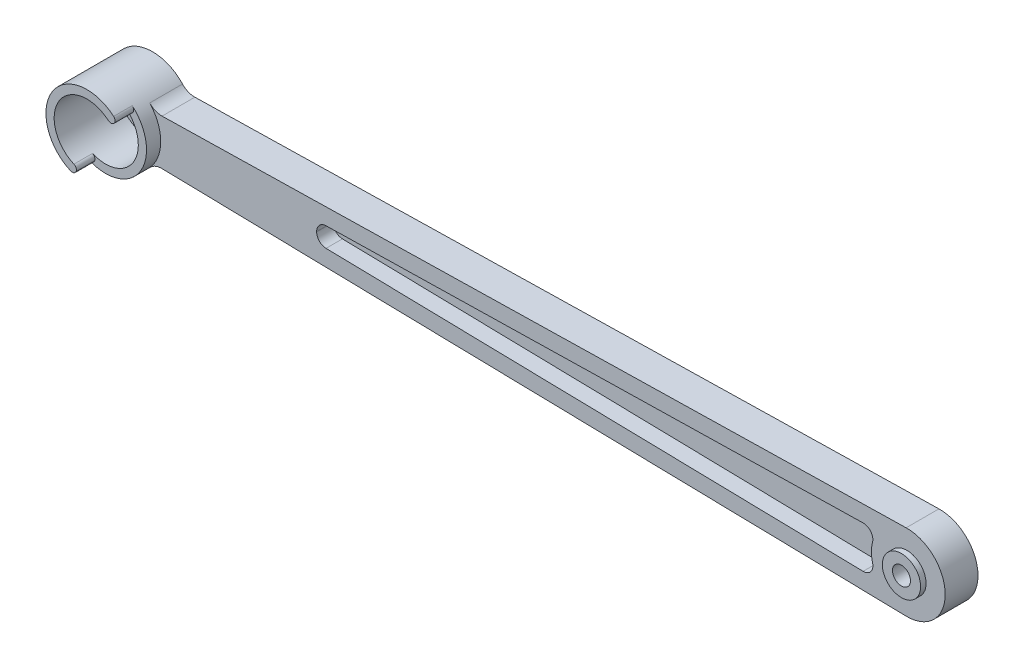
ISO-10303-21;
HEADER;
FILE_DESCRIPTION(('STEP AP214'),'2;1');
FILE_NAME('part.step','',(''),(''),'','','');
FILE_SCHEMA(('AUTOMOTIVE_DESIGN { 1 0 10303 214 1 1 1 1 }'));
ENDSEC;
DATA;
#1=APPLICATION_CONTEXT('core data for automotive mechanical design processes');
#2=APPLICATION_PROTOCOL_DEFINITION('international standard','automotive_design',2000,#1);
#3=PRODUCT_CONTEXT('',#1,'mechanical');
#4=PRODUCT('Part','Part','',(#3));
#5=PRODUCT_RELATED_PRODUCT_CATEGORY('part','',(#4));
#6=PRODUCT_DEFINITION_FORMATION('','',#4);
#7=PRODUCT_DEFINITION_CONTEXT('part definition',#1,'design');
#8=PRODUCT_DEFINITION('design','',#6,#7);
#9=PRODUCT_DEFINITION_SHAPE('','',#8);
#10=(LENGTH_UNIT() NAMED_UNIT(*) SI_UNIT(.MILLI.,.METRE.));
#11=(NAMED_UNIT(*) PLANE_ANGLE_UNIT() SI_UNIT($,.RADIAN.));
#12=(NAMED_UNIT(*) SI_UNIT($,.STERADIAN.) SOLID_ANGLE_UNIT());
#13=UNCERTAINTY_MEASURE_WITH_UNIT(LENGTH_MEASURE(1.E-05),#10,'distance_accuracy_value','');
#14=(GEOMETRIC_REPRESENTATION_CONTEXT(3) GLOBAL_UNCERTAINTY_ASSIGNED_CONTEXT((#13)) GLOBAL_UNIT_ASSIGNED_CONTEXT((#10,
#11,#12)) REPRESENTATION_CONTEXT('',''));
#15=CARTESIAN_POINT('',(0.,0.,0.));
#16=DIRECTION('',(0.,0.,1.));
#17=DIRECTION('',(1.,0.,0.));
#18=AXIS2_PLACEMENT_3D('',#15,#16,#17);
#19=CARTESIAN_POINT('',(0.,0.,6.));
#20=DIRECTION('',(0.,0.,1.));
#21=DIRECTION('',(1.,0.,0.));
#22=AXIS2_PLACEMENT_3D('',#19,#20,#21);
#23=PLANE('',#22);
#24=CARTESIAN_POINT('',(-106.225718101395,-0.0369722305792602,6.));
#25=DIRECTION('',(0.,0.,1.));
#26=DIRECTION('',(-1.,0.,0.));
#27=AXIS2_PLACEMENT_3D('',#24,#25,#26);
#28=CIRCLE('',#27,1.75);
#29=CARTESIAN_POINT('',(-107.975717263159,-0.0352593886860398,6.));
#30=VERTEX_POINT('',#29);
#31=CARTESIAN_POINT('',(-106.262176434729,-1.78659241505661,6.));
#32=VERTEX_POINT('',#31);
#33=EDGE_CURVE('E65',#30,#32,#28,.T.);
#34=ORIENTED_EDGE('',*,*,#33,.F.);
#35=CARTESIAN_POINT('',(-144.,0.,6.));
#36=DIRECTION('',(0.,0.,-1.));
#37=DIRECTION('',(-1.,0.,0.));
#38=AXIS2_PLACEMENT_3D('',#35,#36,#37);
#39=CIRCLE('',#38,36.024299992205);
#40=CARTESIAN_POINT('',(-107.975717263159,0.035259388686048,6.));
#41=VERTEX_POINT('',#40);
#42=EDGE_CURVE('E218',#41,#30,#39,.T.);
#43=ORIENTED_EDGE('',*,*,#42,.F.);
#44=CARTESIAN_POINT('',(-106.225718101395,0.0369722305792741,6.));
#45=DIRECTION('',(0.,0.,1.));
#46=DIRECTION('',(1.,0.,0.));
#47=AXIS2_PLACEMENT_3D('',#44,#45,#46);
#48=CIRCLE('',#47,1.75);
#49=CARTESIAN_POINT('',(-106.262176434729,1.78659241505662,6.));
#50=VERTEX_POINT('',#49);
#51=EDGE_CURVE('E369',#50,#41,#48,.T.);
#52=ORIENTED_EDGE('',*,*,#51,.F.);
#53=DIRECTION('',(-0.999782962558486,-0.0208333333333333,0.));
#54=VECTOR('',#53,1.);
#55=CARTESIAN_POINT('',(-8.01886458524092,3.8337723932924,6.));
#56=LINE('',#55,#54);
#57=CARTESIAN_POINT('',(-8.01886458524092,3.8337723932924,6.));
#58=VERTEX_POINT('',#57);
#59=EDGE_CURVE('E367',#58,#50,#56,.T.);
#60=ORIENTED_EDGE('',*,*,#59,.F.);
#61=CARTESIAN_POINT('',(-7.98240625190759,2.08415220881505,6.));
#62=DIRECTION('',(0.,0.,1.));
#63=DIRECTION('',(1.,0.,0.));
#64=AXIS2_PLACEMENT_3D('',#61,#62,#63);
#65=CIRCLE('',#64,1.75);
#66=CARTESIAN_POINT('',(-6.28916856210903,1.64205931603609,6.));
#67=VERTEX_POINT('',#66);
#68=EDGE_CURVE('E364',#67,#58,#65,.T.);
#69=ORIENTED_EDGE('',*,*,#68,.F.);
#70=CARTESIAN_POINT('',(-1.38777878078145E-13,0.,6.));
#71=DIRECTION('',(0.,0.,-1.));
#72=DIRECTION('',(1.,0.,0.));
#73=AXIS2_PLACEMENT_3D('',#70,#71,#72);
#74=CIRCLE('',#73,6.5);
#75=CARTESIAN_POINT('',(-6.28916856210906,-1.64205931603612,6.));
#76=VERTEX_POINT('',#75);
#77=EDGE_CURVE('E361',#76,#67,#74,.T.);
#78=ORIENTED_EDGE('',*,*,#77,.F.);
#79=CARTESIAN_POINT('',(-7.98240625190762,-2.08415220881505,6.));
#80=DIRECTION('',(0.,0.,1.));
#81=DIRECTION('',(1.,0.,0.));
#82=AXIS2_PLACEMENT_3D('',#79,#80,#81);
#83=CIRCLE('',#82,1.75);
#84=CARTESIAN_POINT('',(-8.01886458524095,-3.8337723932924,6.));
#85=VERTEX_POINT('',#84);
#86=EDGE_CURVE('E358',#85,#76,#83,.T.);
#87=ORIENTED_EDGE('',*,*,#86,.F.);
#88=DIRECTION('',(0.999782962558485,-0.0208333333333333,0.));
#89=VECTOR('',#88,1.);
#90=CARTESIAN_POINT('',(-8.01886458524095,-3.8337723932924,6.));
#91=LINE('',#90,#89);
#92=EDGE_CURVE('E355',#32,#85,#91,.T.);
#93=ORIENTED_EDGE('',*,*,#92,.F.);
#94=EDGE_LOOP('',(#34,#43,#52,#60,#69,#78,#87,#93));
#95=FACE_BOUND('',#94,.T.);
#96=CARTESIAN_POINT('',(-1.38777878078145E-13,0.,6.));
#97=DIRECTION('',(0.,0.,1.));
#98=DIRECTION('',(1.,0.,0.));
#99=AXIS2_PLACEMENT_3D('',#96,#97,#98);
#100=CIRCLE('',#99,3.5);
#101=CARTESIAN_POINT('',(3.49999999999986,0.,6.));
#102=VERTEX_POINT('',#101);
#103=EDGE_CURVE('E252',#102,#102,#100,.T.);
#104=ORIENTED_EDGE('',*,*,#103,.F.);
#105=EDGE_LOOP('',(#104));
#106=FACE_BOUND('',#105,.T.);
#107=CARTESIAN_POINT('',(-136.321293998739,7.16152736126875,6.));
#108=DIRECTION('',(0.,0.,1.));
#109=DIRECTION('',(1.,0.,0.));
#110=AXIS2_PLACEMENT_3D('',#107,#108,#109);
#111=CIRCLE('',#110,3.);
#112=CARTESIAN_POINT('',(-136.258793998739,4.1621784735933,6.));
#113=VERTEX_POINT('',#112);
#114=CARTESIAN_POINT('',(-138.515209999099,5.11537668662054,6.));
#115=VERTEX_POINT('',#114);
#116=EDGE_CURVE('E303',#113,#115,#111,.F.);
#117=ORIENTED_EDGE('',*,*,#116,.T.);
#118=CARTESIAN_POINT('',(-144.,0.,6.));
#119=DIRECTION('',(0.,0.,1.));
#120=DIRECTION('',(1.,0.,0.));
#121=AXIS2_PLACEMENT_3D('',#118,#119,#120);
#122=CIRCLE('',#121,7.50000000000001);
#123=CARTESIAN_POINT('',(-138.515209999099,-5.11537668662054,6.));
#124=VERTEX_POINT('',#123);
#125=EDGE_CURVE('E183',#124,#115,#122,.T.);
#126=ORIENTED_EDGE('',*,*,#125,.F.);
#127=CARTESIAN_POINT('',(-136.321293998739,-7.16152736126875,6.));
#128=DIRECTION('',(0.,0.,1.));
#129=DIRECTION('',(1.,0.,0.));
#130=AXIS2_PLACEMENT_3D('',#127,#128,#129);
#131=CIRCLE('',#130,3.);
#132=CARTESIAN_POINT('',(-136.258793998739,-4.1621784735933,6.));
#133=VERTEX_POINT('',#132);
#134=EDGE_CURVE('E299',#124,#133,#131,.F.);
#135=ORIENTED_EDGE('',*,*,#134,.T.);
#136=DIRECTION('',(-0.999782962558486,0.0208333333333333,0.));
#137=VECTOR('',#136,1.);
#138=CARTESIAN_POINT('',(-0.145833333333333,-6.9984807379094,6.));
#139=LINE('',#138,#137);
#140=CARTESIAN_POINT('',(-0.145833333333334,-6.9984807379094,6.));
#141=VERTEX_POINT('',#140);
#142=EDGE_CURVE('E259',#141,#133,#139,.T.);
#143=ORIENTED_EDGE('',*,*,#142,.F.);
#144=CARTESIAN_POINT('',(0.,0.,6.));
#145=DIRECTION('',(0.,0.,1.));
#146=DIRECTION('',(1.,0.,0.));
#147=AXIS2_PLACEMENT_3D('',#144,#145,#146);
#148=CIRCLE('',#147,7.);
#149=CARTESIAN_POINT('',(-0.145833333333333,6.9984807379094,6.));
#150=VERTEX_POINT('',#149);
#151=EDGE_CURVE('E262',#141,#150,#148,.T.);
#152=ORIENTED_EDGE('',*,*,#151,.T.);
#153=DIRECTION('',(-0.999782962558486,-0.0208333333333333,0.));
#154=VECTOR('',#153,1.);
#155=CARTESIAN_POINT('',(-0.145833333333333,6.9984807379094,6.));
#156=LINE('',#155,#154);
#157=EDGE_CURVE('E266',#150,#113,#156,.T.);
#158=ORIENTED_EDGE('',*,*,#157,.T.);
#159=EDGE_LOOP('',(#117,#126,#135,#143,#152,#158));
#160=FACE_BOUND('',#159,.T.);
#161=ADVANCED_FACE('F43',(#95,#106,#160),#23,.T.);
#162=CARTESIAN_POINT('',(-144.,0.,6.));
#163=DIRECTION('',(0.,0.,-1.));
#164=DIRECTION('',(-1.,0.,0.));
#165=AXIS2_PLACEMENT_3D('',#162,#163,#164);
#166=CYLINDRICAL_SURFACE('',#165,6.00000000000002);
#167=DIRECTION('',(0.,0.,-1.));
#168=VECTOR('',#167,1.);
#169=CARTESIAN_POINT('',(-146.380513939489,-5.50755421070891,6.));
#170=LINE('',#169,#168);
#171=CARTESIAN_POINT('',(-146.380513939489,-5.50755421070891,12.));
#172=VERTEX_POINT('',#171);
#173=CARTESIAN_POINT('',(-146.380513939489,-5.50755421070891,8.6));
#174=VERTEX_POINT('',#173);
#175=EDGE_CURVE('E51',#172,#174,#170,.T.);
#176=ORIENTED_EDGE('',*,*,#175,.T.);
#177=CARTESIAN_POINT('',(-144.,0.,8.6));
#178=DIRECTION('',(0.,0.,1.));
#179=DIRECTION('',(1.,0.,0.));
#180=AXIS2_PLACEMENT_3D('',#177,#178,#179);
#181=CIRCLE('',#180,6.00000000000002);
#182=CARTESIAN_POINT('',(-140.094037648829,4.55449866738714,8.6));
#183=VERTEX_POINT('',#182);
#184=EDGE_CURVE('E58',#174,#183,#181,.T.);
#185=ORIENTED_EDGE('',*,*,#184,.T.);
#186=DIRECTION('',(0.,0.,-1.));
#187=VECTOR('',#186,1.);
#188=CARTESIAN_POINT('',(-140.094037648829,4.55449866738714,6.));
#189=LINE('',#188,#187);
#190=CARTESIAN_POINT('',(-140.094037648829,4.55449866738714,12.));
#191=VERTEX_POINT('',#190);
#192=EDGE_CURVE('E199',#183,#191,#189,.F.);
#193=ORIENTED_EDGE('',*,*,#192,.T.);
#194=CARTESIAN_POINT('',(-144.,0.,12.));
#195=DIRECTION('',(0.,0.,1.));
#196=DIRECTION('',(1.,0.,0.));
#197=AXIS2_PLACEMENT_3D('',#194,#195,#196);
#198=CIRCLE('',#197,6.00000000000002);
#199=EDGE_CURVE('E198',#172,#191,#198,.F.);
#200=ORIENTED_EDGE('',*,*,#199,.F.);
#201=EDGE_LOOP('',(#176,#185,#193,#200));
#202=FACE_BOUND('',#201,.T.);
#203=CARTESIAN_POINT('',(-144.,0.,0.6));
#204=DIRECTION('',(0.,0.,-1.));
#205=DIRECTION('',(-1.,0.,0.));
#206=AXIS2_PLACEMENT_3D('',#203,#204,#205);
#207=CIRCLE('',#206,6.00000000000002);
#208=CARTESIAN_POINT('',(-150.,0.,0.6));
#209=VERTEX_POINT('',#208);
#210=EDGE_CURVE('E241',#209,#209,#207,.T.);
#211=ORIENTED_EDGE('',*,*,#210,.T.);
#212=EDGE_LOOP('',(#211));
#213=FACE_BOUND('',#212,.T.);
#214=ADVANCED_FACE('F195',(#202,#213),#166,.F.);
#215=CARTESIAN_POINT('',(-0.145833333333333,-6.9984807379094,6.));
#216=DIRECTION('',(-0.0208333333333333,-0.999782962558486,0.));
#217=DIRECTION('',(0.999782962558486,-0.0208333333333333,0.));
#218=AXIS2_PLACEMENT_3D('',#215,#216,#217);
#219=PLANE('',#218);
#220=ORIENTED_EDGE('',*,*,#142,.T.);
#221=DIRECTION('',(0.,0.,-1.));
#222=VECTOR('',#221,1.);
#223=CARTESIAN_POINT('',(-136.258793998739,-4.1621784735933,6.));
#224=LINE('',#223,#222);
#225=CARTESIAN_POINT('',(-136.258793998739,-4.1621784735933,0.));
#226=VERTEX_POINT('',#225);
#227=EDGE_CURVE('E286',#133,#226,#224,.T.);
#228=ORIENTED_EDGE('',*,*,#227,.T.);
#229=DIRECTION('',(-0.999782962558486,0.0208333333333333,0.));
#230=VECTOR('',#229,1.);
#231=CARTESIAN_POINT('',(-0.145833333333333,-6.9984807379094,0.));
#232=LINE('',#231,#230);
#233=CARTESIAN_POINT('',(-0.145833333333334,-6.9984807379094,0.));
#234=VERTEX_POINT('',#233);
#235=EDGE_CURVE('E256',#234,#226,#232,.T.);
#236=ORIENTED_EDGE('',*,*,#235,.F.);
#237=DIRECTION('',(0.,0.,-1.));
#238=VECTOR('',#237,1.);
#239=CARTESIAN_POINT('',(-0.145833333333334,-6.9984807379094,6.));
#240=LINE('',#239,#238);
#241=EDGE_CURVE('E284',#141,#234,#240,.T.);
#242=ORIENTED_EDGE('',*,*,#241,.F.);
#243=EDGE_LOOP('',(#220,#228,#236,#242));
#244=FACE_BOUND('',#243,.T.);
#245=ADVANCED_FACE('F417',(#244),#219,.T.);
#246=CARTESIAN_POINT('',(0.,0.,6.));
#247=DIRECTION('',(0.,0.,-1.));
#248=DIRECTION('',(-1.,0.,0.));
#249=AXIS2_PLACEMENT_3D('',#246,#247,#248);
#250=CYLINDRICAL_SURFACE('',#249,7.);
#251=CARTESIAN_POINT('',(0.,0.,0.));
#252=DIRECTION('',(0.,0.,1.));
#253=DIRECTION('',(1.,0.,0.));
#254=AXIS2_PLACEMENT_3D('',#251,#252,#253);
#255=CIRCLE('',#254,7.);
#256=CARTESIAN_POINT('',(-0.145833333333333,6.9984807379094,0.));
#257=VERTEX_POINT('',#256);
#258=EDGE_CURVE('E272',#234,#257,#255,.T.);
#259=ORIENTED_EDGE('',*,*,#258,.T.);
#260=DIRECTION('',(0.,0.,-1.));
#261=VECTOR('',#260,1.);
#262=CARTESIAN_POINT('',(-0.145833333333333,6.9984807379094,6.));
#263=LINE('',#262,#261);
#264=EDGE_CURVE('E269',#150,#257,#263,.T.);
#265=ORIENTED_EDGE('',*,*,#264,.F.);
#266=ORIENTED_EDGE('',*,*,#151,.F.);
#267=ORIENTED_EDGE('',*,*,#241,.T.);
#268=EDGE_LOOP('',(#259,#265,#266,#267));
#269=FACE_BOUND('',#268,.T.);
#270=ADVANCED_FACE('F434',(#269),#250,.T.);
#271=CARTESIAN_POINT('',(-0.145833333333333,6.9984807379094,6.));
#272=DIRECTION('',(0.0208333333333333,-0.999782962558486,0.));
#273=DIRECTION('',(0.999782962558486,0.0208333333333333,0.));
#274=AXIS2_PLACEMENT_3D('',#271,#272,#273);
#275=PLANE('',#274);
#276=DIRECTION('',(-0.999782962558486,-0.0208333333333333,0.));
#277=VECTOR('',#276,1.);
#278=CARTESIAN_POINT('',(-0.145833333333333,6.9984807379094,0.));
#279=LINE('',#278,#277);
#280=CARTESIAN_POINT('',(-136.258793998739,4.1621784735933,0.));
#281=VERTEX_POINT('',#280);
#282=EDGE_CURVE('E275',#257,#281,#279,.T.);
#283=ORIENTED_EDGE('',*,*,#282,.T.);
#284=DIRECTION('',(0.,0.,1.));
#285=VECTOR('',#284,1.);
#286=CARTESIAN_POINT('',(-136.258793998739,4.1621784735933,6.));
#287=LINE('',#286,#285);
#288=EDGE_CURVE('E295',#281,#113,#287,.T.);
#289=ORIENTED_EDGE('',*,*,#288,.T.);
#290=ORIENTED_EDGE('',*,*,#157,.F.);
#291=ORIENTED_EDGE('',*,*,#264,.T.);
#292=EDGE_LOOP('',(#283,#289,#290,#291));
#293=FACE_BOUND('',#292,.T.);
#294=ADVANCED_FACE('F430',(#293),#275,.F.);
#295=CARTESIAN_POINT('',(-144.,0.,6.));
#296=DIRECTION('',(0.,0.,-1.));
#297=DIRECTION('',(-1.,0.,0.));
#298=AXIS2_PLACEMENT_3D('',#295,#296,#297);
#299=CYLINDRICAL_SURFACE('',#298,7.50000000000001);
#300=DIRECTION('',(0.,0.,-1.));
#301=VECTOR('',#300,1.);
#302=CARTESIAN_POINT('',(-139.117547061036,5.69312333423392,6.));
#303=LINE('',#302,#301);
#304=CARTESIAN_POINT('',(-139.117547061036,5.69312333423392,12.));
#305=VERTEX_POINT('',#304);
#306=CARTESIAN_POINT('',(-139.117547061036,5.69312333423392,8.6));
#307=VERTEX_POINT('',#306);
#308=EDGE_CURVE('E306',#305,#307,#303,.T.);
#309=ORIENTED_EDGE('',*,*,#308,.T.);
#310=CARTESIAN_POINT('',(-144.,0.,8.6));
#311=DIRECTION('',(0.,0.,1.));
#312=DIRECTION('',(1.,0.,0.));
#313=AXIS2_PLACEMENT_3D('',#310,#311,#312);
#314=CIRCLE('',#313,7.50000000000001);
#315=CARTESIAN_POINT('',(-146.975642424362,-6.88444276338614,8.6));
#316=VERTEX_POINT('',#315);
#317=EDGE_CURVE('E328',#316,#307,#314,.T.);
#318=ORIENTED_EDGE('',*,*,#317,.F.);
#319=DIRECTION('',(0.,0.,-1.));
#320=VECTOR('',#319,1.);
#321=CARTESIAN_POINT('',(-146.975642424362,-6.88444276338614,6.));
#322=LINE('',#321,#320);
#323=CARTESIAN_POINT('',(-146.975642424362,-6.88444276338614,12.));
#324=VERTEX_POINT('',#323);
#325=EDGE_CURVE('E309',#316,#324,#322,.F.);
#326=ORIENTED_EDGE('',*,*,#325,.T.);
#327=CARTESIAN_POINT('',(-144.,0.,12.));
#328=DIRECTION('',(0.,0.,1.));
#329=DIRECTION('',(1.,0.,0.));
#330=AXIS2_PLACEMENT_3D('',#327,#328,#329);
#331=CIRCLE('',#330,7.50000000000001);
#332=EDGE_CURVE('E234',#305,#324,#331,.T.);
#333=ORIENTED_EDGE('',*,*,#332,.F.);
#334=EDGE_LOOP('',(#309,#318,#326,#333));
#335=FACE_BOUND('',#334,.T.);
#336=ORIENTED_EDGE('',*,*,#125,.T.);
#337=DIRECTION('',(0.,0.,-1.));
#338=VECTOR('',#337,1.);
#339=CARTESIAN_POINT('',(-138.515209999099,5.11537668662054,6.));
#340=LINE('',#339,#338);
#341=CARTESIAN_POINT('',(-138.515209999099,5.11537668662054,0.));
#342=VERTEX_POINT('',#341);
#343=EDGE_CURVE('E289',#115,#342,#340,.T.);
#344=ORIENTED_EDGE('',*,*,#343,.T.);
#345=CARTESIAN_POINT('',(-144.,0.,0.));
#346=DIRECTION('',(0.,0.,1.));
#347=DIRECTION('',(1.,0.,0.));
#348=AXIS2_PLACEMENT_3D('',#345,#346,#347);
#349=CIRCLE('',#348,7.50000000000001);
#350=CARTESIAN_POINT('',(-138.515209999099,-5.11537668662054,0.));
#351=VERTEX_POINT('',#350);
#352=EDGE_CURVE('E263',#342,#351,#349,.T.);
#353=ORIENTED_EDGE('',*,*,#352,.T.);
#354=DIRECTION('',(0.,0.,-1.));
#355=VECTOR('',#354,1.);
#356=CARTESIAN_POINT('',(-138.515209999099,-5.11537668662054,6.));
#357=LINE('',#356,#355);
#358=EDGE_CURVE('E292',#351,#124,#357,.F.);
#359=ORIENTED_EDGE('',*,*,#358,.T.);
#360=EDGE_LOOP('',(#336,#344,#353,#359));
#361=FACE_BOUND('',#360,.T.);
#362=ADVANCED_FACE('F426',(#335,#361),#299,.T.);
#363=CARTESIAN_POINT('',(0.,0.,0.));
#364=DIRECTION('',(0.,0.,1.));
#365=DIRECTION('',(1.,0.,0.));
#366=AXIS2_PLACEMENT_3D('',#363,#364,#365);
#367=PLANE('',#366);
#368=CARTESIAN_POINT('',(-1.38777878078145E-13,0.,0.));
#369=DIRECTION('',(0.,0.,1.));
#370=DIRECTION('',(1.,0.,0.));
#371=AXIS2_PLACEMENT_3D('',#368,#369,#370);
#372=CIRCLE('',#371,1.65);
#373=CARTESIAN_POINT('',(1.64999999999986,0.,0.));
#374=VERTEX_POINT('',#373);
#375=EDGE_CURVE('E249',#374,#374,#372,.T.);
#376=ORIENTED_EDGE('',*,*,#375,.T.);
#377=EDGE_LOOP('',(#376));
#378=FACE_BOUND('',#377,.T.);
#379=ORIENTED_EDGE('',*,*,#235,.T.);
#380=CARTESIAN_POINT('',(-136.321293998739,-7.16152736126875,0.));
#381=DIRECTION('',(0.,0.,1.));
#382=DIRECTION('',(1.,0.,0.));
#383=AXIS2_PLACEMENT_3D('',#380,#381,#382);
#384=CIRCLE('',#383,3.);
#385=EDGE_CURVE('E297',#226,#351,#384,.T.);
#386=ORIENTED_EDGE('',*,*,#385,.T.);
#387=ORIENTED_EDGE('',*,*,#352,.F.);
#388=CARTESIAN_POINT('',(-136.321293998739,7.16152736126875,0.));
#389=DIRECTION('',(0.,0.,1.));
#390=DIRECTION('',(1.,0.,0.));
#391=AXIS2_PLACEMENT_3D('',#388,#389,#390);
#392=CIRCLE('',#391,3.);
#393=EDGE_CURVE('E301',#342,#281,#392,.T.);
#394=ORIENTED_EDGE('',*,*,#393,.T.);
#395=ORIENTED_EDGE('',*,*,#282,.F.);
#396=ORIENTED_EDGE('',*,*,#258,.F.);
#397=EDGE_LOOP('',(#379,#386,#387,#394,#395,#396));
#398=FACE_BOUND('',#397,.T.);
#399=CARTESIAN_POINT('',(-144.,0.,0.));
#400=DIRECTION('',(0.,0.,-1.));
#401=DIRECTION('',(-1.,0.,0.));
#402=AXIS2_PLACEMENT_3D('',#399,#400,#401);
#403=CIRCLE('',#402,4.99999999999999);
#404=CARTESIAN_POINT('',(-149.,0.,0.));
#405=VERTEX_POINT('',#404);
#406=EDGE_CURVE('E237',#405,#405,#403,.T.);
#407=ORIENTED_EDGE('',*,*,#406,.F.);
#408=EDGE_LOOP('',(#407));
#409=FACE_BOUND('',#408,.T.);
#410=ADVANCED_FACE('F423',(#378,#398,#409),#367,.F.);
#411=CARTESIAN_POINT('',(-1.38777878078145E-13,0.,7.));
#412=DIRECTION('',(0.,0.,-1.));
#413=DIRECTION('',(-1.,0.,0.));
#414=AXIS2_PLACEMENT_3D('',#411,#412,#413);
#415=CYLINDRICAL_SURFACE('',#414,3.5);
#416=CARTESIAN_POINT('',(-1.38777878078145E-13,0.,7.));
#417=DIRECTION('',(0.,0.,1.));
#418=DIRECTION('',(1.,0.,0.));
#419=AXIS2_PLACEMENT_3D('',#416,#417,#418);
#420=CIRCLE('',#419,3.5);
#421=CARTESIAN_POINT('',(3.49999999999986,0.,7.));
#422=VERTEX_POINT('',#421);
#423=EDGE_CURVE('E253',#422,#422,#420,.T.);
#424=ORIENTED_EDGE('',*,*,#423,.F.);
#425=EDGE_LOOP('',(#424));
#426=FACE_BOUND('',#425,.T.);
#427=ORIENTED_EDGE('',*,*,#103,.T.);
#428=EDGE_LOOP('',(#427));
#429=FACE_BOUND('',#428,.T.);
#430=ADVANCED_FACE('F421',(#426,#429),#415,.T.);
#431=CARTESIAN_POINT('',(-1.38777878078145E-13,0.,7.));
#432=DIRECTION('',(0.,0.,1.));
#433=DIRECTION('',(1.,0.,0.));
#434=AXIS2_PLACEMENT_3D('',#431,#432,#433);
#435=PLANE('',#434);
#436=CARTESIAN_POINT('',(-1.38777878078145E-13,0.,7.));
#437=DIRECTION('',(0.,0.,1.));
#438=DIRECTION('',(1.,0.,0.));
#439=AXIS2_PLACEMENT_3D('',#436,#437,#438);
#440=CIRCLE('',#439,1.65);
#441=CARTESIAN_POINT('',(1.64999999999986,0.,7.));
#442=VERTEX_POINT('',#441);
#443=EDGE_CURVE('E246',#442,#442,#440,.T.);
#444=ORIENTED_EDGE('',*,*,#443,.F.);
#445=EDGE_LOOP('',(#444));
#446=FACE_BOUND('',#445,.T.);
#447=ORIENTED_EDGE('',*,*,#423,.T.);
#448=EDGE_LOOP('',(#447));
#449=FACE_BOUND('',#448,.T.);
#450=ADVANCED_FACE('F500',(#446,#449),#435,.T.);
#451=CARTESIAN_POINT('',(-1.38777878078145E-13,0.,-5.));
#452=DIRECTION('',(0.,0.,1.));
#453=DIRECTION('',(1.,0.,0.));
#454=AXIS2_PLACEMENT_3D('',#451,#452,#453);
#455=CYLINDRICAL_SURFACE('',#454,1.65);
#456=ORIENTED_EDGE('',*,*,#443,.T.);
#457=EDGE_LOOP('',(#456));
#458=FACE_BOUND('',#457,.T.);
#459=ORIENTED_EDGE('',*,*,#375,.F.);
#460=EDGE_LOOP('',(#459));
#461=FACE_BOUND('',#460,.T.);
#462=ADVANCED_FACE('F493',(#458,#461),#455,.F.);
#463=CARTESIAN_POINT('',(-144.,0.,0.6));
#464=DIRECTION('',(0.,0.,-1.));
#465=DIRECTION('',(-1.,0.,0.));
#466=AXIS2_PLACEMENT_3D('',#463,#464,#465);
#467=PLANE('',#466);
#468=CARTESIAN_POINT('',(-144.,0.,0.6));
#469=DIRECTION('',(0.,0.,-1.));
#470=DIRECTION('',(-1.,0.,0.));
#471=AXIS2_PLACEMENT_3D('',#468,#469,#470);
#472=CIRCLE('',#471,4.99999999999999);
#473=CARTESIAN_POINT('',(-149.,0.,0.6));
#474=VERTEX_POINT('',#473);
#475=EDGE_CURVE('E238',#474,#474,#472,.T.);
#476=ORIENTED_EDGE('',*,*,#475,.T.);
#477=EDGE_LOOP('',(#476));
#478=FACE_BOUND('',#477,.T.);
#479=ORIENTED_EDGE('',*,*,#210,.F.);
#480=EDGE_LOOP('',(#479));
#481=FACE_BOUND('',#480,.T.);
#482=ADVANCED_FACE('F487',(#478,#481),#467,.F.);
#483=CARTESIAN_POINT('',(-144.,0.,0.6));
#484=DIRECTION('',(0.,0.,-1.));
#485=DIRECTION('',(-1.,0.,0.));
#486=AXIS2_PLACEMENT_3D('',#483,#484,#485);
#487=CYLINDRICAL_SURFACE('',#486,4.99999999999999);
#488=ORIENTED_EDGE('',*,*,#475,.F.);
#489=EDGE_LOOP('',(#488));
#490=FACE_BOUND('',#489,.T.);
#491=ORIENTED_EDGE('',*,*,#406,.T.);
#492=EDGE_LOOP('',(#491));
#493=FACE_BOUND('',#492,.T.);
#494=ADVANCED_FACE('F446',(#490,#493),#487,.F.);
#495=CARTESIAN_POINT('',(-136.321293998739,-7.16152736126875,6.));
#496=DIRECTION('',(0.,0.,-1.));
#497=DIRECTION('',(-1.,0.,0.));
#498=AXIS2_PLACEMENT_3D('',#495,#496,#497);
#499=CYLINDRICAL_SURFACE('',#498,3.);
#500=ORIENTED_EDGE('',*,*,#134,.F.);
#501=ORIENTED_EDGE('',*,*,#358,.F.);
#502=ORIENTED_EDGE('',*,*,#385,.F.);
#503=ORIENTED_EDGE('',*,*,#227,.F.);
#504=EDGE_LOOP('',(#500,#501,#502,#503));
#505=FACE_BOUND('',#504,.T.);
#506=ADVANCED_FACE('F442',(#505),#499,.F.);
#507=CARTESIAN_POINT('',(-136.321293998739,7.16152736126875,6.));
#508=DIRECTION('',(0.,0.,-1.));
#509=DIRECTION('',(-1.,0.,0.));
#510=AXIS2_PLACEMENT_3D('',#507,#508,#509);
#511=CYLINDRICAL_SURFACE('',#510,3.);
#512=ORIENTED_EDGE('',*,*,#116,.F.);
#513=ORIENTED_EDGE('',*,*,#288,.F.);
#514=ORIENTED_EDGE('',*,*,#393,.F.);
#515=ORIENTED_EDGE('',*,*,#343,.F.);
#516=EDGE_LOOP('',(#512,#513,#514,#515));
#517=FACE_BOUND('',#516,.T.);
#518=ADVANCED_FACE('F445',(#517),#511,.F.);
#519=CARTESIAN_POINT('',(0.,0.,12.));
#520=DIRECTION('',(0.,0.,1.));
#521=DIRECTION('',(1.,0.,0.));
#522=AXIS2_PLACEMENT_3D('',#519,#520,#521);
#523=PLANE('',#522);
#524=ORIENTED_EDGE('',*,*,#332,.T.);
#525=CARTESIAN_POINT('',(-146.678078181925,-6.19599848704752,12.));
#526=DIRECTION('',(0.,0.,1.));
#527=DIRECTION('',(1.,0.,0.));
#528=AXIS2_PLACEMENT_3D('',#525,#526,#527);
#529=CIRCLE('',#528,0.75);
#530=CARTESIAN_POINT('',(-145.960834065826,-6.41522640023678,12.));
#531=VERTEX_POINT('',#530);
#532=EDGE_CURVE('E201',#324,#531,#529,.T.);
#533=ORIENTED_EDGE('',*,*,#532,.T.);
#534=CARTESIAN_POINT('',(-146.678078181925,-6.19599848704752,12.));
#535=DIRECTION('',(0.,0.,1.));
#536=DIRECTION('',(1.,0.,0.));
#537=AXIS2_PLACEMENT_3D('',#534,#535,#536);
#538=CIRCLE('',#537,0.75);
#539=EDGE_CURVE('E315',#531,#172,#538,.T.);
#540=ORIENTED_EDGE('',*,*,#539,.T.);
#541=ORIENTED_EDGE('',*,*,#199,.T.);
#542=CARTESIAN_POINT('',(-139.605792354932,5.12381100081054,12.));
#543=DIRECTION('',(0.,0.,1.));
#544=DIRECTION('',(1.,0.,0.));
#545=AXIS2_PLACEMENT_3D('',#542,#543,#544);
#546=CIRCLE('',#545,0.75);
#547=CARTESIAN_POINT('',(-139.09425468627,4.57533200072045,12.));
#548=VERTEX_POINT('',#547);
#549=EDGE_CURVE('E313',#191,#548,#546,.T.);
#550=ORIENTED_EDGE('',*,*,#549,.T.);
#551=CARTESIAN_POINT('',(-139.605792354932,5.12381100081053,12.));
#552=DIRECTION('',(0.,0.,1.));
#553=DIRECTION('',(1.,0.,0.));
#554=AXIS2_PLACEMENT_3D('',#551,#552,#553);
#555=CIRCLE('',#554,0.75);
#556=EDGE_CURVE('E311',#548,#305,#555,.T.);
#557=ORIENTED_EDGE('',*,*,#556,.T.);
#558=EDGE_LOOP('',(#524,#533,#540,#541,#550,#557));
#559=FACE_BOUND('',#558,.T.);
#560=ADVANCED_FACE('F319',(#559),#523,.T.);
#561=CARTESIAN_POINT('',(-146.678078181925,-6.19599848704752,6.));
#562=DIRECTION('',(0.,0.,-1.));
#563=DIRECTION('',(-1.,0.,0.));
#564=AXIS2_PLACEMENT_3D('',#561,#562,#563);
#565=CYLINDRICAL_SURFACE('',#564,0.75);
#566=CARTESIAN_POINT('',(-146.678078181925,-6.19599848704752,8.6));
#567=DIRECTION('',(0.,0.,1.));
#568=DIRECTION('',(1.,0.,0.));
#569=AXIS2_PLACEMENT_3D('',#566,#567,#568);
#570=CIRCLE('',#569,0.75);
#571=CARTESIAN_POINT('',(-145.960834065826,-6.41522640023678,8.6));
#572=VERTEX_POINT('',#571);
#573=EDGE_CURVE('E179',#174,#572,#570,.F.);
#574=ORIENTED_EDGE('',*,*,#573,.F.);
#575=ORIENTED_EDGE('',*,*,#175,.F.);
#576=ORIENTED_EDGE('',*,*,#539,.F.);
#577=DIRECTION('',(0.,0.,-1.));
#578=VECTOR('',#577,1.);
#579=CARTESIAN_POINT('',(-145.960834065826,-6.41522640023678,12.));
#580=LINE('',#579,#578);
#581=EDGE_CURVE('E190',#572,#531,#580,.F.);
#582=ORIENTED_EDGE('',*,*,#581,.F.);
#583=EDGE_LOOP('',(#574,#575,#576,#582));
#584=FACE_BOUND('',#583,.T.);
#585=ADVANCED_FACE('F188',(#584),#565,.T.);
#586=CARTESIAN_POINT('',(-146.678078181925,-6.19599848704752,6.));
#587=DIRECTION('',(0.,0.,-1.));
#588=DIRECTION('',(-1.,0.,0.));
#589=AXIS2_PLACEMENT_3D('',#586,#587,#588);
#590=CYLINDRICAL_SURFACE('',#589,0.75);
#591=CARTESIAN_POINT('',(-146.678078181925,-6.19599848704752,8.6));
#592=DIRECTION('',(0.,0.,1.));
#593=DIRECTION('',(1.,0.,0.));
#594=AXIS2_PLACEMENT_3D('',#591,#592,#593);
#595=CIRCLE('',#594,0.75);
#596=EDGE_CURVE('E192',#572,#316,#595,.F.);
#597=ORIENTED_EDGE('',*,*,#596,.F.);
#598=ORIENTED_EDGE('',*,*,#581,.T.);
#599=ORIENTED_EDGE('',*,*,#532,.F.);
#600=ORIENTED_EDGE('',*,*,#325,.F.);
#601=EDGE_LOOP('',(#597,#598,#599,#600));
#602=FACE_BOUND('',#601,.T.);
#603=ADVANCED_FACE('F323',(#602),#590,.T.);
#604=CARTESIAN_POINT('',(-139.605792354932,5.12381100081053,6.));
#605=DIRECTION('',(0.,0.,-1.));
#606=DIRECTION('',(-1.,0.,0.));
#607=AXIS2_PLACEMENT_3D('',#604,#605,#606);
#608=CYLINDRICAL_SURFACE('',#607,0.75);
#609=CARTESIAN_POINT('',(-139.605792354932,5.12381100081053,8.6));
#610=DIRECTION('',(0.,0.,1.));
#611=DIRECTION('',(1.,0.,0.));
#612=AXIS2_PLACEMENT_3D('',#609,#610,#611);
#613=CIRCLE('',#612,0.75);
#614=CARTESIAN_POINT('',(-139.09425468627,4.57533200072047,8.6));
#615=VERTEX_POINT('',#614);
#616=EDGE_CURVE('E325',#307,#615,#613,.F.);
#617=ORIENTED_EDGE('',*,*,#616,.F.);
#618=ORIENTED_EDGE('',*,*,#308,.F.);
#619=ORIENTED_EDGE('',*,*,#556,.F.);
#620=DIRECTION('',(0.,0.,-1.));
#621=VECTOR('',#620,1.);
#622=CARTESIAN_POINT('',(-139.09425468627,4.57533200072048,12.));
#623=LINE('',#622,#621);
#624=EDGE_CURVE('E205',#615,#548,#623,.F.);
#625=ORIENTED_EDGE('',*,*,#624,.F.);
#626=EDGE_LOOP('',(#617,#618,#619,#625));
#627=FACE_BOUND('',#626,.T.);
#628=ADVANCED_FACE('F45',(#627),#608,.T.);
#629=CARTESIAN_POINT('',(-139.605792354932,5.12381100081054,6.));
#630=DIRECTION('',(0.,0.,-1.));
#631=DIRECTION('',(-1.,0.,0.));
#632=AXIS2_PLACEMENT_3D('',#629,#630,#631);
#633=CYLINDRICAL_SURFACE('',#632,0.75);
#634=CARTESIAN_POINT('',(-139.605792354932,5.12381100081054,8.6));
#635=DIRECTION('',(0.,0.,1.));
#636=DIRECTION('',(1.,0.,0.));
#637=AXIS2_PLACEMENT_3D('',#634,#635,#636);
#638=CIRCLE('',#637,0.75);
#639=EDGE_CURVE('E12',#615,#183,#638,.F.);
#640=ORIENTED_EDGE('',*,*,#639,.F.);
#641=ORIENTED_EDGE('',*,*,#624,.T.);
#642=ORIENTED_EDGE('',*,*,#549,.F.);
#643=ORIENTED_EDGE('',*,*,#192,.F.);
#644=EDGE_LOOP('',(#640,#641,#642,#643));
#645=FACE_BOUND('',#644,.T.);
#646=ADVANCED_FACE('F454',(#645),#633,.T.);
#647=CARTESIAN_POINT('',(-106.225718101395,-0.0369722305792602,3.));
#648=DIRECTION('',(0.,0.,1.));
#649=DIRECTION('',(1.,0.,0.));
#650=AXIS2_PLACEMENT_3D('',#647,#648,#649);
#651=CYLINDRICAL_SURFACE('',#650,1.75);
#652=ORIENTED_EDGE('',*,*,#33,.T.);
#653=DIRECTION('',(0.,0.,1.));
#654=VECTOR('',#653,1.);
#655=CARTESIAN_POINT('',(-106.262176434729,-1.78659241505661,3.));
#656=LINE('',#655,#654);
#657=CARTESIAN_POINT('',(-106.262176434729,-1.78659241505661,3.));
#658=VERTEX_POINT('',#657);
#659=EDGE_CURVE('E230',#658,#32,#656,.T.);
#660=ORIENTED_EDGE('',*,*,#659,.F.);
#661=CARTESIAN_POINT('',(-106.225718101395,-0.0369722305792602,3.));
#662=DIRECTION('',(0.,0.,1.));
#663=DIRECTION('',(-1.,0.,0.));
#664=AXIS2_PLACEMENT_3D('',#661,#662,#663);
#665=CIRCLE('',#664,1.75);
#666=CARTESIAN_POINT('',(-107.975717263159,-0.0352593886860398,3.));
#667=VERTEX_POINT('',#666);
#668=EDGE_CURVE('E331',#667,#658,#665,.T.);
#669=ORIENTED_EDGE('',*,*,#668,.F.);
#670=DIRECTION('',(0.,0.,1.));
#671=VECTOR('',#670,1.);
#672=CARTESIAN_POINT('',(-107.975717263159,-0.0352593886860398,3.));
#673=LINE('',#672,#671);
#674=EDGE_CURVE('E206',#667,#30,#673,.T.);
#675=ORIENTED_EDGE('',*,*,#674,.T.);
#676=EDGE_LOOP('',(#652,#660,#669,#675));
#677=FACE_BOUND('',#676,.T.);
#678=ADVANCED_FACE('F386',(#677),#651,.F.);
#679=CARTESIAN_POINT('',(-144.,0.,3.));
#680=DIRECTION('',(0.,0.,1.));
#681=DIRECTION('',(1.,0.,0.));
#682=AXIS2_PLACEMENT_3D('',#679,#680,#681);
#683=CYLINDRICAL_SURFACE('',#682,36.024299992205);
#684=ORIENTED_EDGE('',*,*,#42,.T.);
#685=ORIENTED_EDGE('',*,*,#674,.F.);
#686=CARTESIAN_POINT('',(-144.,0.,3.));
#687=DIRECTION('',(0.,0.,-1.));
#688=DIRECTION('',(-1.,0.,0.));
#689=AXIS2_PLACEMENT_3D('',#686,#687,#688);
#690=CIRCLE('',#689,36.024299992205);
#691=CARTESIAN_POINT('',(-107.975717263159,0.035259388686048,3.));
#692=VERTEX_POINT('',#691);
#693=EDGE_CURVE('E232',#692,#667,#690,.T.);
#694=ORIENTED_EDGE('',*,*,#693,.F.);
#695=DIRECTION('',(0.,0.,1.));
#696=VECTOR('',#695,1.);
#697=CARTESIAN_POINT('',(-107.975717263159,0.035259388686048,3.));
#698=LINE('',#697,#696);
#699=EDGE_CURVE('E211',#692,#41,#698,.T.);
#700=ORIENTED_EDGE('',*,*,#699,.T.);
#701=EDGE_LOOP('',(#684,#685,#694,#700));
#702=FACE_BOUND('',#701,.T.);
#703=ADVANCED_FACE('F375',(#702),#683,.T.);
#704=CARTESIAN_POINT('',(-106.225718101395,0.0369722305792741,3.));
#705=DIRECTION('',(0.,0.,1.));
#706=DIRECTION('',(1.,0.,0.));
#707=AXIS2_PLACEMENT_3D('',#704,#705,#706);
#708=CYLINDRICAL_SURFACE('',#707,1.75);
#709=ORIENTED_EDGE('',*,*,#51,.T.);
#710=ORIENTED_EDGE('',*,*,#699,.F.);
#711=CARTESIAN_POINT('',(-106.225718101395,0.0369722305792741,3.));
#712=DIRECTION('',(0.,0.,1.));
#713=DIRECTION('',(1.,0.,0.));
#714=AXIS2_PLACEMENT_3D('',#711,#712,#713);
#715=CIRCLE('',#714,1.75);
#716=CARTESIAN_POINT('',(-106.262176434729,1.78659241505662,3.));
#717=VERTEX_POINT('',#716);
#718=EDGE_CURVE('E349',#717,#692,#715,.T.);
#719=ORIENTED_EDGE('',*,*,#718,.F.);
#720=DIRECTION('',(0.,0.,1.));
#721=VECTOR('',#720,1.);
#722=CARTESIAN_POINT('',(-106.262176434729,1.78659241505662,3.));
#723=LINE('',#722,#721);
#724=EDGE_CURVE('E215',#717,#50,#723,.T.);
#725=ORIENTED_EDGE('',*,*,#724,.T.);
#726=EDGE_LOOP('',(#709,#710,#719,#725));
#727=FACE_BOUND('',#726,.T.);
#728=ADVANCED_FACE('F391',(#727),#708,.F.);
#729=CARTESIAN_POINT('',(-8.01886458524092,3.8337723932924,3.));
#730=DIRECTION('',(-0.0208333333333333,0.999782962558486,0.));
#731=DIRECTION('',(-0.999782962558486,-0.0208333333333333,0.));
#732=AXIS2_PLACEMENT_3D('',#729,#730,#731);
#733=PLANE('',#732);
#734=ORIENTED_EDGE('',*,*,#59,.T.);
#735=ORIENTED_EDGE('',*,*,#724,.F.);
#736=DIRECTION('',(-0.999782962558486,-0.0208333333333333,0.));
#737=VECTOR('',#736,1.);
#738=CARTESIAN_POINT('',(-8.01886458524092,3.8337723932924,3.));
#739=LINE('',#738,#737);
#740=CARTESIAN_POINT('',(-8.01886458524092,3.8337723932924,3.));
#741=VERTEX_POINT('',#740);
#742=EDGE_CURVE('E346',#741,#717,#739,.T.);
#743=ORIENTED_EDGE('',*,*,#742,.F.);
#744=DIRECTION('',(0.,0.,1.));
#745=VECTOR('',#744,1.);
#746=CARTESIAN_POINT('',(-8.01886458524092,3.8337723932924,3.));
#747=LINE('',#746,#745);
#748=EDGE_CURVE('E222',#741,#58,#747,.T.);
#749=ORIENTED_EDGE('',*,*,#748,.T.);
#750=EDGE_LOOP('',(#734,#735,#743,#749));
#751=FACE_BOUND('',#750,.T.);
#752=ADVANCED_FACE('F394',(#751),#733,.F.);
#753=CARTESIAN_POINT('',(-7.98240625190759,2.08415220881505,3.));
#754=DIRECTION('',(0.,0.,1.));
#755=DIRECTION('',(1.,0.,0.));
#756=AXIS2_PLACEMENT_3D('',#753,#754,#755);
#757=CYLINDRICAL_SURFACE('',#756,1.75);
#758=ORIENTED_EDGE('',*,*,#68,.T.);
#759=ORIENTED_EDGE('',*,*,#748,.F.);
#760=CARTESIAN_POINT('',(-7.98240625190759,2.08415220881505,3.));
#761=DIRECTION('',(0.,0.,1.));
#762=DIRECTION('',(1.,0.,0.));
#763=AXIS2_PLACEMENT_3D('',#760,#761,#762);
#764=CIRCLE('',#763,1.75);
#765=CARTESIAN_POINT('',(-6.28916856210903,1.64205931603609,3.));
#766=VERTEX_POINT('',#765);
#767=EDGE_CURVE('E343',#766,#741,#764,.T.);
#768=ORIENTED_EDGE('',*,*,#767,.F.);
#769=DIRECTION('',(0.,0.,1.));
#770=VECTOR('',#769,1.);
#771=CARTESIAN_POINT('',(-6.28916856210903,1.64205931603609,3.));
#772=LINE('',#771,#770);
#773=EDGE_CURVE('E224',#766,#67,#772,.T.);
#774=ORIENTED_EDGE('',*,*,#773,.T.);
#775=EDGE_LOOP('',(#758,#759,#768,#774));
#776=FACE_BOUND('',#775,.T.);
#777=ADVANCED_FACE('F397',(#776),#757,.F.);
#778=CARTESIAN_POINT('',(-1.38777878078145E-13,0.,3.));
#779=DIRECTION('',(0.,0.,1.));
#780=DIRECTION('',(1.,0.,0.));
#781=AXIS2_PLACEMENT_3D('',#778,#779,#780);
#782=CYLINDRICAL_SURFACE('',#781,6.5);
#783=ORIENTED_EDGE('',*,*,#77,.T.);
#784=ORIENTED_EDGE('',*,*,#773,.F.);
#785=CARTESIAN_POINT('',(-1.38777878078145E-13,0.,3.));
#786=DIRECTION('',(0.,0.,-1.));
#787=DIRECTION('',(1.,0.,0.));
#788=AXIS2_PLACEMENT_3D('',#785,#786,#787);
#789=CIRCLE('',#788,6.5);
#790=CARTESIAN_POINT('',(-6.28916856210906,-1.64205931603612,3.));
#791=VERTEX_POINT('',#790);
#792=EDGE_CURVE('E340',#791,#766,#789,.T.);
#793=ORIENTED_EDGE('',*,*,#792,.F.);
#794=DIRECTION('',(0.,0.,1.));
#795=VECTOR('',#794,1.);
#796=CARTESIAN_POINT('',(-6.28916856210906,-1.64205931603612,3.));
#797=LINE('',#796,#795);
#798=EDGE_CURVE('E226',#791,#76,#797,.T.);
#799=ORIENTED_EDGE('',*,*,#798,.T.);
#800=EDGE_LOOP('',(#783,#784,#793,#799));
#801=FACE_BOUND('',#800,.T.);
#802=ADVANCED_FACE('F401',(#801),#782,.T.);
#803=CARTESIAN_POINT('',(-7.98240625190762,-2.08415220881505,3.));
#804=DIRECTION('',(0.,0.,1.));
#805=DIRECTION('',(1.,0.,0.));
#806=AXIS2_PLACEMENT_3D('',#803,#804,#805);
#807=CYLINDRICAL_SURFACE('',#806,1.75);
#808=ORIENTED_EDGE('',*,*,#86,.T.);
#809=ORIENTED_EDGE('',*,*,#798,.F.);
#810=CARTESIAN_POINT('',(-7.98240625190762,-2.08415220881505,3.));
#811=DIRECTION('',(0.,0.,1.));
#812=DIRECTION('',(1.,0.,0.));
#813=AXIS2_PLACEMENT_3D('',#810,#811,#812);
#814=CIRCLE('',#813,1.75);
#815=CARTESIAN_POINT('',(-8.01886458524095,-3.8337723932924,3.));
#816=VERTEX_POINT('',#815);
#817=EDGE_CURVE('E337',#816,#791,#814,.T.);
#818=ORIENTED_EDGE('',*,*,#817,.F.);
#819=DIRECTION('',(0.,0.,1.));
#820=VECTOR('',#819,1.);
#821=CARTESIAN_POINT('',(-8.01886458524095,-3.8337723932924,3.));
#822=LINE('',#821,#820);
#823=EDGE_CURVE('E228',#816,#85,#822,.T.);
#824=ORIENTED_EDGE('',*,*,#823,.T.);
#825=EDGE_LOOP('',(#808,#809,#818,#824));
#826=FACE_BOUND('',#825,.T.);
#827=ADVANCED_FACE('F403',(#826),#807,.F.);
#828=CARTESIAN_POINT('',(-8.01886458524095,-3.8337723932924,3.));
#829=DIRECTION('',(-0.0208333333333334,-0.999782962558486,0.));
#830=DIRECTION('',(0.999782962558486,-0.0208333333333334,0.));
#831=AXIS2_PLACEMENT_3D('',#828,#829,#830);
#832=PLANE('',#831);
#833=ORIENTED_EDGE('',*,*,#92,.T.);
#834=ORIENTED_EDGE('',*,*,#823,.F.);
#835=DIRECTION('',(0.999782962558485,-0.0208333333333333,0.));
#836=VECTOR('',#835,1.);
#837=CARTESIAN_POINT('',(-8.01886458524095,-3.8337723932924,3.));
#838=LINE('',#837,#836);
#839=EDGE_CURVE('E334',#658,#816,#838,.T.);
#840=ORIENTED_EDGE('',*,*,#839,.F.);
#841=ORIENTED_EDGE('',*,*,#659,.T.);
#842=EDGE_LOOP('',(#833,#834,#840,#841));
#843=FACE_BOUND('',#842,.T.);
#844=ADVANCED_FACE('F383',(#843),#832,.F.);
#845=CARTESIAN_POINT('',(-106.225718101395,-0.0369722305792602,3.));
#846=DIRECTION('',(0.,0.,-1.));
#847=DIRECTION('',(-1.,0.,0.));
#848=AXIS2_PLACEMENT_3D('',#845,#846,#847);
#849=PLANE('',#848);
#850=ORIENTED_EDGE('',*,*,#668,.T.);
#851=ORIENTED_EDGE('',*,*,#839,.T.);
#852=ORIENTED_EDGE('',*,*,#817,.T.);
#853=ORIENTED_EDGE('',*,*,#792,.T.);
#854=ORIENTED_EDGE('',*,*,#767,.T.);
#855=ORIENTED_EDGE('',*,*,#742,.T.);
#856=ORIENTED_EDGE('',*,*,#718,.T.);
#857=ORIENTED_EDGE('',*,*,#693,.T.);
#858=EDGE_LOOP('',(#850,#851,#852,#853,#854,#855,#856,#857));
#859=FACE_BOUND('',#858,.T.);
#860=ADVANCED_FACE('F388',(#859),#849,.F.);
#861=CARTESIAN_POINT('',(-144.,0.,8.6));
#862=DIRECTION('',(0.,0.,1.));
#863=DIRECTION('',(1.,0.,0.));
#864=AXIS2_PLACEMENT_3D('',#861,#862,#863);
#865=PLANE('',#864);
#866=ORIENTED_EDGE('',*,*,#184,.F.);
#867=ORIENTED_EDGE('',*,*,#573,.T.);
#868=ORIENTED_EDGE('',*,*,#596,.T.);
#869=ORIENTED_EDGE('',*,*,#317,.T.);
#870=ORIENTED_EDGE('',*,*,#616,.T.);
#871=ORIENTED_EDGE('',*,*,#639,.T.);
#872=EDGE_LOOP('',(#866,#867,#868,#869,#870,#871));
#873=FACE_BOUND('',#872,.T.);
#874=ADVANCED_FACE('F178',(#873),#865,.T.);
#875=CLOSED_SHELL('',(#161,#214,#245,#270,#294,#362,#410,#430,#450,#462,#482,#494,#506,#518,
#560,#585,#603,#628,#646,#678,#703,#728,#752,#777,#802,#827,#844,#860,#874));
#876=MANIFOLD_SOLID_BREP('B2',#875);
#877=ADVANCED_BREP_SHAPE_REPRESENTATION('',(#18,#876),#14);
#878=SHAPE_DEFINITION_REPRESENTATION(#9,#877);
ENDSEC;
END-ISO-10303-21;
